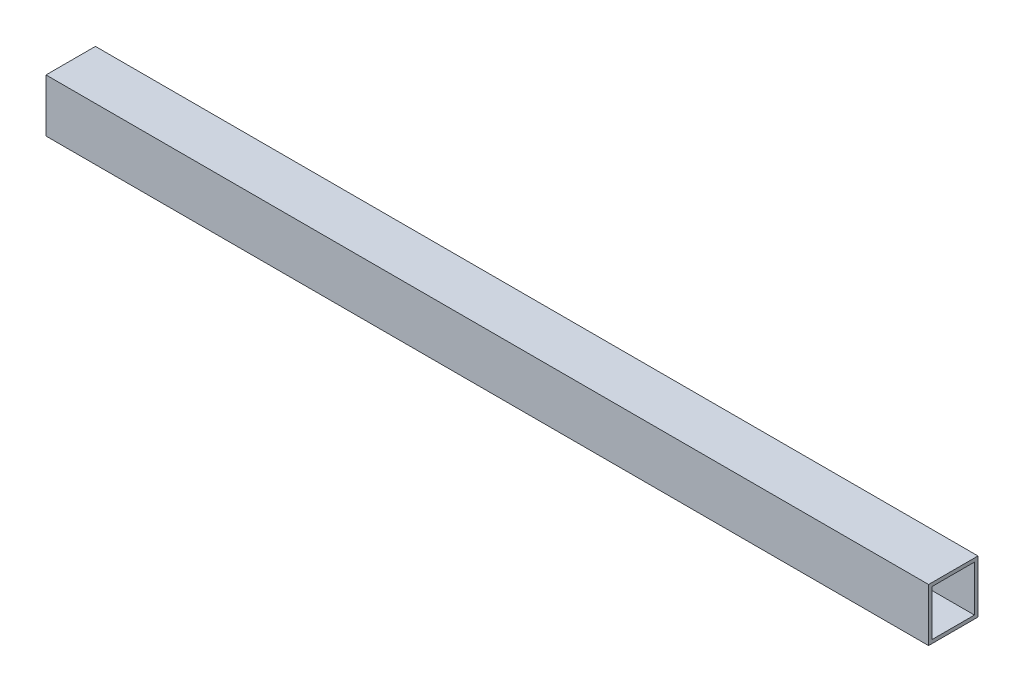
ISO-10303-21;
HEADER;
FILE_DESCRIPTION(('STEP AP214'),'2;1');
FILE_NAME('part.step','',(''),(''),'','','');
FILE_SCHEMA(('AUTOMOTIVE_DESIGN { 1 0 10303 214 1 1 1 1 }'));
ENDSEC;
DATA;
#1=APPLICATION_CONTEXT('core data for automotive mechanical design processes');
#2=APPLICATION_PROTOCOL_DEFINITION('international standard','automotive_design',2000,#1);
#3=PRODUCT_CONTEXT('',#1,'mechanical');
#4=PRODUCT('Part','Part','',(#3));
#5=PRODUCT_RELATED_PRODUCT_CATEGORY('part','',(#4));
#6=PRODUCT_DEFINITION_FORMATION('','',#4);
#7=PRODUCT_DEFINITION_CONTEXT('part definition',#1,'design');
#8=PRODUCT_DEFINITION('design','',#6,#7);
#9=PRODUCT_DEFINITION_SHAPE('','',#8);
#10=(LENGTH_UNIT() NAMED_UNIT(*) SI_UNIT(.MILLI.,.METRE.));
#11=(NAMED_UNIT(*) PLANE_ANGLE_UNIT() SI_UNIT($,.RADIAN.));
#12=(NAMED_UNIT(*) SI_UNIT($,.STERADIAN.) SOLID_ANGLE_UNIT());
#13=UNCERTAINTY_MEASURE_WITH_UNIT(LENGTH_MEASURE(1.E-05),#10,'distance_accuracy_value','');
#14=(GEOMETRIC_REPRESENTATION_CONTEXT(3) GLOBAL_UNCERTAINTY_ASSIGNED_CONTEXT((#13)) GLOBAL_UNIT_ASSIGNED_CONTEXT((#10,
#11,#12)) REPRESENTATION_CONTEXT('',''));
#15=CARTESIAN_POINT('',(0.,0.,0.));
#16=DIRECTION('',(0.,0.,1.));
#17=DIRECTION('',(1.,0.,0.));
#18=AXIS2_PLACEMENT_3D('',#15,#16,#17);
#19=CARTESIAN_POINT('',(1250.,0.,0.));
#20=DIRECTION('',(1.,0.,0.));
#21=DIRECTION('',(0.,0.,-1.));
#22=AXIS2_PLACEMENT_3D('',#19,#20,#21);
#23=PLANE('',#22);
#24=DIRECTION('',(0.,1.,0.));
#25=VECTOR('',#24,1.);
#26=CARTESIAN_POINT('',(1250.,37.5,-35.));
#27=LINE('',#26,#25);
#28=CARTESIAN_POINT('',(1250.,-37.5,-35.));
#29=VERTEX_POINT('',#28);
#30=CARTESIAN_POINT('',(1250.,37.5,-35.));
#31=VERTEX_POINT('',#30);
#32=EDGE_CURVE('E159',#29,#31,#27,.T.);
#33=ORIENTED_EDGE('',*,*,#32,.T.);
#34=DIRECTION('',(0.,0.,1.));
#35=VECTOR('',#34,1.);
#36=CARTESIAN_POINT('',(1250.,37.5,35.));
#37=LINE('',#36,#35);
#38=CARTESIAN_POINT('',(1250.,37.5,35.));
#39=VERTEX_POINT('',#38);
#40=EDGE_CURVE('E162',#31,#39,#37,.T.);
#41=ORIENTED_EDGE('',*,*,#40,.T.);
#42=DIRECTION('',(0.,-1.,0.));
#43=VECTOR('',#42,1.);
#44=CARTESIAN_POINT('',(1250.,37.5,35.));
#45=LINE('',#44,#43);
#46=CARTESIAN_POINT('',(1250.,-37.5,35.));
#47=VERTEX_POINT('',#46);
#48=EDGE_CURVE('E165',#39,#47,#45,.T.);
#49=ORIENTED_EDGE('',*,*,#48,.T.);
#50=DIRECTION('',(0.,0.,-1.));
#51=VECTOR('',#50,1.);
#52=CARTESIAN_POINT('',(1250.,-37.5,35.));
#53=LINE('',#52,#51);
#54=EDGE_CURVE('E167',#47,#29,#53,.T.);
#55=ORIENTED_EDGE('',*,*,#54,.T.);
#56=EDGE_LOOP('',(#33,#41,#49,#55));
#57=FACE_BOUND('',#56,.T.);
#58=DIRECTION('',(0.,0.,1.));
#59=VECTOR('',#58,1.);
#60=CARTESIAN_POINT('',(1250.,32.5,35.));
#61=LINE('',#60,#59);
#62=CARTESIAN_POINT('',(1250.,32.5,-30.));
#63=VERTEX_POINT('',#62);
#64=CARTESIAN_POINT('',(1250.,32.5,30.));
#65=VERTEX_POINT('',#64);
#66=EDGE_CURVE('E131',#63,#65,#61,.T.);
#67=ORIENTED_EDGE('',*,*,#66,.F.);
#68=DIRECTION('',(0.,1.,0.));
#69=VECTOR('',#68,1.);
#70=CARTESIAN_POINT('',(1250.,37.5,-30.));
#71=LINE('',#70,#69);
#72=CARTESIAN_POINT('',(1250.,-32.5,-30.));
#73=VERTEX_POINT('',#72);
#74=EDGE_CURVE('E123',#73,#63,#71,.T.);
#75=ORIENTED_EDGE('',*,*,#74,.F.);
#76=DIRECTION('',(0.,0.,-1.));
#77=VECTOR('',#76,1.);
#78=CARTESIAN_POINT('',(1250.,-32.5,35.));
#79=LINE('',#78,#77);
#80=CARTESIAN_POINT('',(1250.,-32.5,30.));
#81=VERTEX_POINT('',#80);
#82=EDGE_CURVE('E145',#81,#73,#79,.T.);
#83=ORIENTED_EDGE('',*,*,#82,.F.);
#84=DIRECTION('',(0.,-1.,0.));
#85=VECTOR('',#84,1.);
#86=CARTESIAN_POINT('',(1250.,37.5,30.));
#87=LINE('',#86,#85);
#88=EDGE_CURVE('E143',#65,#81,#87,.T.);
#89=ORIENTED_EDGE('',*,*,#88,.F.);
#90=EDGE_LOOP('',(#67,#75,#83,#89));
#91=FACE_BOUND('',#90,.T.);
#92=ADVANCED_FACE('F58',(#57,#91),#23,.T.);
#93=CARTESIAN_POINT('',(0.,0.,0.));
#94=DIRECTION('',(1.,0.,0.));
#95=DIRECTION('',(0.,0.,-1.));
#96=AXIS2_PLACEMENT_3D('',#93,#94,#95);
#97=PLANE('',#96);
#98=DIRECTION('',(0.,1.,0.));
#99=VECTOR('',#98,1.);
#100=CARTESIAN_POINT('',(0.,37.5,-35.));
#101=LINE('',#100,#99);
#102=CARTESIAN_POINT('',(0.,-37.5,-35.));
#103=VERTEX_POINT('',#102);
#104=CARTESIAN_POINT('',(0.,37.5,-35.));
#105=VERTEX_POINT('',#104);
#106=EDGE_CURVE('E139',#103,#105,#101,.T.);
#107=ORIENTED_EDGE('',*,*,#106,.F.);
#108=DIRECTION('',(0.,0.,-1.));
#109=VECTOR('',#108,1.);
#110=CARTESIAN_POINT('',(0.,-37.5,35.));
#111=LINE('',#110,#109);
#112=CARTESIAN_POINT('',(0.,-37.5,35.));
#113=VERTEX_POINT('',#112);
#114=EDGE_CURVE('E163',#113,#103,#111,.T.);
#115=ORIENTED_EDGE('',*,*,#114,.F.);
#116=DIRECTION('',(0.,-1.,0.));
#117=VECTOR('',#116,1.);
#118=CARTESIAN_POINT('',(0.,37.5,35.));
#119=LINE('',#118,#117);
#120=CARTESIAN_POINT('',(0.,37.5,35.));
#121=VERTEX_POINT('',#120);
#122=EDGE_CURVE('E174',#121,#113,#119,.T.);
#123=ORIENTED_EDGE('',*,*,#122,.F.);
#124=DIRECTION('',(0.,0.,1.));
#125=VECTOR('',#124,1.);
#126=CARTESIAN_POINT('',(0.,37.5,35.));
#127=LINE('',#126,#125);
#128=EDGE_CURVE('E172',#105,#121,#127,.T.);
#129=ORIENTED_EDGE('',*,*,#128,.F.);
#130=EDGE_LOOP('',(#107,#115,#123,#129));
#131=FACE_BOUND('',#130,.T.);
#132=DIRECTION('',(0.,1.,0.));
#133=VECTOR('',#132,1.);
#134=CARTESIAN_POINT('',(0.,37.5,-30.));
#135=LINE('',#134,#133);
#136=CARTESIAN_POINT('',(0.,-32.5,-30.));
#137=VERTEX_POINT('',#136);
#138=CARTESIAN_POINT('',(0.,32.5,-30.));
#139=VERTEX_POINT('',#138);
#140=EDGE_CURVE('E81',#137,#139,#135,.T.);
#141=ORIENTED_EDGE('',*,*,#140,.T.);
#142=DIRECTION('',(0.,0.,1.));
#143=VECTOR('',#142,1.);
#144=CARTESIAN_POINT('',(0.,32.5,35.));
#145=LINE('',#144,#143);
#146=CARTESIAN_POINT('',(0.,32.5,30.));
#147=VERTEX_POINT('',#146);
#148=EDGE_CURVE('E138',#139,#147,#145,.T.);
#149=ORIENTED_EDGE('',*,*,#148,.T.);
#150=DIRECTION('',(0.,-1.,0.));
#151=VECTOR('',#150,1.);
#152=CARTESIAN_POINT('',(0.,37.5,30.));
#153=LINE('',#152,#151);
#154=CARTESIAN_POINT('',(0.,-32.5,30.));
#155=VERTEX_POINT('',#154);
#156=EDGE_CURVE('E151',#147,#155,#153,.T.);
#157=ORIENTED_EDGE('',*,*,#156,.T.);
#158=DIRECTION('',(0.,0.,-1.));
#159=VECTOR('',#158,1.);
#160=CARTESIAN_POINT('',(0.,-32.5,35.));
#161=LINE('',#160,#159);
#162=EDGE_CURVE('E132',#155,#137,#161,.T.);
#163=ORIENTED_EDGE('',*,*,#162,.T.);
#164=EDGE_LOOP('',(#141,#149,#157,#163));
#165=FACE_BOUND('',#164,.T.);
#166=ADVANCED_FACE('F192',(#131,#165),#97,.F.);
#167=CARTESIAN_POINT('',(1250.,37.5,-35.));
#168=DIRECTION('',(0.,0.,1.));
#169=DIRECTION('',(0.,-1.,0.));
#170=AXIS2_PLACEMENT_3D('',#167,#168,#169);
#171=PLANE('',#170);
#172=ORIENTED_EDGE('',*,*,#106,.T.);
#173=DIRECTION('',(-1.,0.,0.));
#174=VECTOR('',#173,1.);
#175=CARTESIAN_POINT('',(1250.,37.5,-35.));
#176=LINE('',#175,#174);
#177=EDGE_CURVE('E12',#31,#105,#176,.T.);
#178=ORIENTED_EDGE('',*,*,#177,.F.);
#179=ORIENTED_EDGE('',*,*,#32,.F.);
#180=DIRECTION('',(-1.,0.,0.));
#181=VECTOR('',#180,1.);
#182=CARTESIAN_POINT('',(1250.,-37.5,-35.));
#183=LINE('',#182,#181);
#184=EDGE_CURVE('E169',#29,#103,#183,.T.);
#185=ORIENTED_EDGE('',*,*,#184,.T.);
#186=EDGE_LOOP('',(#172,#178,#179,#185));
#187=FACE_BOUND('',#186,.T.);
#188=ADVANCED_FACE('F60',(#187),#171,.F.);
#189=CARTESIAN_POINT('',(1250.,37.5,35.));
#190=DIRECTION('',(0.,-1.,0.));
#191=DIRECTION('',(0.,0.,-1.));
#192=AXIS2_PLACEMENT_3D('',#189,#190,#191);
#193=PLANE('',#192);
#194=ORIENTED_EDGE('',*,*,#128,.T.);
#195=DIRECTION('',(-1.,0.,0.));
#196=VECTOR('',#195,1.);
#197=CARTESIAN_POINT('',(1250.,37.5,35.));
#198=LINE('',#197,#196);
#199=EDGE_CURVE('E66',#39,#121,#198,.T.);
#200=ORIENTED_EDGE('',*,*,#199,.F.);
#201=ORIENTED_EDGE('',*,*,#40,.F.);
#202=ORIENTED_EDGE('',*,*,#177,.T.);
#203=EDGE_LOOP('',(#194,#200,#201,#202));
#204=FACE_BOUND('',#203,.T.);
#205=ADVANCED_FACE('F202',(#204),#193,.F.);
#206=CARTESIAN_POINT('',(1250.,37.5,35.));
#207=DIRECTION('',(0.,0.,-1.));
#208=DIRECTION('',(0.,1.,0.));
#209=AXIS2_PLACEMENT_3D('',#206,#207,#208);
#210=PLANE('',#209);
#211=ORIENTED_EDGE('',*,*,#122,.T.);
#212=DIRECTION('',(-1.,0.,0.));
#213=VECTOR('',#212,1.);
#214=CARTESIAN_POINT('',(1250.,-37.5,35.));
#215=LINE('',#214,#213);
#216=EDGE_CURVE('E179',#47,#113,#215,.T.);
#217=ORIENTED_EDGE('',*,*,#216,.F.);
#218=ORIENTED_EDGE('',*,*,#48,.F.);
#219=ORIENTED_EDGE('',*,*,#199,.T.);
#220=EDGE_LOOP('',(#211,#217,#218,#219));
#221=FACE_BOUND('',#220,.T.);
#222=ADVANCED_FACE('F186',(#221),#210,.F.);
#223=CARTESIAN_POINT('',(1250.,-37.5,35.));
#224=DIRECTION('',(0.,1.,0.));
#225=DIRECTION('',(0.,0.,1.));
#226=AXIS2_PLACEMENT_3D('',#223,#224,#225);
#227=PLANE('',#226);
#228=ORIENTED_EDGE('',*,*,#114,.T.);
#229=ORIENTED_EDGE('',*,*,#184,.F.);
#230=ORIENTED_EDGE('',*,*,#54,.F.);
#231=ORIENTED_EDGE('',*,*,#216,.T.);
#232=EDGE_LOOP('',(#228,#229,#230,#231));
#233=FACE_BOUND('',#232,.T.);
#234=ADVANCED_FACE('F196',(#233),#227,.F.);
#235=CARTESIAN_POINT('',(1250.,37.5,-30.));
#236=DIRECTION('',(0.,0.,1.));
#237=DIRECTION('',(0.,-1.,0.));
#238=AXIS2_PLACEMENT_3D('',#235,#236,#237);
#239=PLANE('',#238);
#240=ORIENTED_EDGE('',*,*,#140,.F.);
#241=DIRECTION('',(-1.,0.,0.));
#242=VECTOR('',#241,1.);
#243=CARTESIAN_POINT('',(1250.,-32.5,-30.));
#244=LINE('',#243,#242);
#245=EDGE_CURVE('E127',#73,#137,#244,.T.);
#246=ORIENTED_EDGE('',*,*,#245,.F.);
#247=ORIENTED_EDGE('',*,*,#74,.T.);
#248=DIRECTION('',(-1.,0.,0.));
#249=VECTOR('',#248,1.);
#250=CARTESIAN_POINT('',(1250.,32.5,-30.));
#251=LINE('',#250,#249);
#252=EDGE_CURVE('E126',#63,#139,#251,.T.);
#253=ORIENTED_EDGE('',*,*,#252,.T.);
#254=EDGE_LOOP('',(#240,#246,#247,#253));
#255=FACE_BOUND('',#254,.T.);
#256=ADVANCED_FACE('F125',(#255),#239,.T.);
#257=CARTESIAN_POINT('',(1250.,32.5,35.));
#258=DIRECTION('',(0.,-1.,0.));
#259=DIRECTION('',(0.,0.,-1.));
#260=AXIS2_PLACEMENT_3D('',#257,#258,#259);
#261=PLANE('',#260);
#262=ORIENTED_EDGE('',*,*,#148,.F.);
#263=ORIENTED_EDGE('',*,*,#252,.F.);
#264=ORIENTED_EDGE('',*,*,#66,.T.);
#265=DIRECTION('',(-1.,0.,0.));
#266=VECTOR('',#265,1.);
#267=CARTESIAN_POINT('',(1250.,32.5,30.));
#268=LINE('',#267,#266);
#269=EDGE_CURVE('E140',#65,#147,#268,.T.);
#270=ORIENTED_EDGE('',*,*,#269,.T.);
#271=EDGE_LOOP('',(#262,#263,#264,#270));
#272=FACE_BOUND('',#271,.T.);
#273=ADVANCED_FACE('F135',(#272),#261,.T.);
#274=CARTESIAN_POINT('',(1250.,37.5,30.));
#275=DIRECTION('',(0.,0.,-1.));
#276=DIRECTION('',(0.,1.,0.));
#277=AXIS2_PLACEMENT_3D('',#274,#275,#276);
#278=PLANE('',#277);
#279=ORIENTED_EDGE('',*,*,#156,.F.);
#280=ORIENTED_EDGE('',*,*,#269,.F.);
#281=ORIENTED_EDGE('',*,*,#88,.T.);
#282=DIRECTION('',(-1.,0.,0.));
#283=VECTOR('',#282,1.);
#284=CARTESIAN_POINT('',(1250.,-32.5,30.));
#285=LINE('',#284,#283);
#286=EDGE_CURVE('E73',#81,#155,#285,.T.);
#287=ORIENTED_EDGE('',*,*,#286,.T.);
#288=EDGE_LOOP('',(#279,#280,#281,#287));
#289=FACE_BOUND('',#288,.T.);
#290=ADVANCED_FACE('F225',(#289),#278,.T.);
#291=CARTESIAN_POINT('',(1250.,-32.5,35.));
#292=DIRECTION('',(0.,1.,0.));
#293=DIRECTION('',(0.,0.,1.));
#294=AXIS2_PLACEMENT_3D('',#291,#292,#293);
#295=PLANE('',#294);
#296=ORIENTED_EDGE('',*,*,#162,.F.);
#297=ORIENTED_EDGE('',*,*,#286,.F.);
#298=ORIENTED_EDGE('',*,*,#82,.T.);
#299=ORIENTED_EDGE('',*,*,#245,.T.);
#300=EDGE_LOOP('',(#296,#297,#298,#299));
#301=FACE_BOUND('',#300,.T.);
#302=ADVANCED_FACE('F229',(#301),#295,.T.);
#303=CLOSED_SHELL('',(#92,#166,#188,#205,#222,#234,#256,#273,#290,#302));
#304=MANIFOLD_SOLID_BREP('B2',#303);
#305=ADVANCED_BREP_SHAPE_REPRESENTATION('',(#18,#304),#14);
#306=SHAPE_DEFINITION_REPRESENTATION(#9,#305);
ENDSEC;
END-ISO-10303-21;
